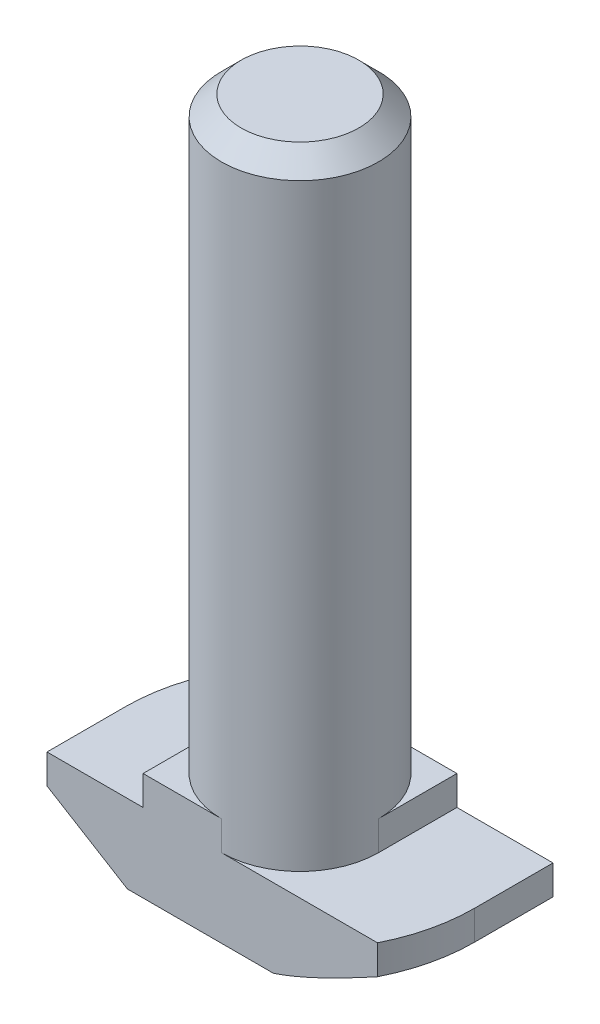
ISO-10303-21;
HEADER;
FILE_DESCRIPTION(('STEP AP214'),'2;1');
FILE_NAME('part.step','',(''),(''),'','','');
FILE_SCHEMA(('AUTOMOTIVE_DESIGN { 1 0 10303 214 1 1 1 1 }'));
ENDSEC;
DATA;
#1=APPLICATION_CONTEXT('core data for automotive mechanical design processes');
#2=APPLICATION_PROTOCOL_DEFINITION('international standard','automotive_design',2000,#1);
#3=PRODUCT_CONTEXT('',#1,'mechanical');
#4=PRODUCT('Part','Part','',(#3));
#5=PRODUCT_RELATED_PRODUCT_CATEGORY('part','',(#4));
#6=PRODUCT_DEFINITION_FORMATION('','',#4);
#7=PRODUCT_DEFINITION_CONTEXT('part definition',#1,'design');
#8=PRODUCT_DEFINITION('design','',#6,#7);
#9=PRODUCT_DEFINITION_SHAPE('','',#8);
#10=(LENGTH_UNIT() NAMED_UNIT(*) SI_UNIT(.MILLI.,.METRE.));
#11=(NAMED_UNIT(*) PLANE_ANGLE_UNIT() SI_UNIT($,.RADIAN.));
#12=(NAMED_UNIT(*) SI_UNIT($,.STERADIAN.) SOLID_ANGLE_UNIT());
#13=UNCERTAINTY_MEASURE_WITH_UNIT(LENGTH_MEASURE(1.E-05),#10,'distance_accuracy_value','');
#14=(GEOMETRIC_REPRESENTATION_CONTEXT(3) GLOBAL_UNCERTAINTY_ASSIGNED_CONTEXT((#13)) GLOBAL_UNIT_ASSIGNED_CONTEXT((#10,
#11,#12)) REPRESENTATION_CONTEXT('',''));
#15=CARTESIAN_POINT('',(0.,0.,0.));
#16=DIRECTION('',(0.,0.,1.));
#17=DIRECTION('',(1.,0.,0.));
#18=AXIS2_PLACEMENT_3D('',#15,#16,#17);
#19=CARTESIAN_POINT('',(-8.9,0.,4.));
#20=DIRECTION('',(1.,0.,0.));
#21=DIRECTION('',(0.,0.,-1.));
#22=AXIS2_PLACEMENT_3D('',#19,#20,#21);
#23=PLANE('',#22);
#24=DIRECTION('',(0.,0.,-1.));
#25=VECTOR('',#24,1.);
#26=CARTESIAN_POINT('',(-8.9,2.5,4.));
#27=LINE('',#26,#25);
#28=CARTESIAN_POINT('',(-8.9,2.5,4.));
#29=VERTEX_POINT('',#28);
#30=CARTESIAN_POINT('',(-8.9,2.5,0.));
#31=VERTEX_POINT('',#30);
#32=EDGE_CURVE('E369',#29,#31,#27,.T.);
#33=ORIENTED_EDGE('',*,*,#32,.F.);
#34=DIRECTION('',(0.,-1.,0.));
#35=VECTOR('',#34,1.);
#36=CARTESIAN_POINT('',(-8.9,0.,4.));
#37=LINE('',#36,#35);
#38=CARTESIAN_POINT('',(-8.9,4.,4.));
#39=VERTEX_POINT('',#38);
#40=EDGE_CURVE('E209',#39,#29,#37,.T.);
#41=ORIENTED_EDGE('',*,*,#40,.F.);
#42=DIRECTION('',(0.,0.,-1.));
#43=VECTOR('',#42,1.);
#44=CARTESIAN_POINT('',(-8.9,4.,4.));
#45=LINE('',#44,#43);
#46=CARTESIAN_POINT('',(-8.9,4.,0.));
#47=VERTEX_POINT('',#46);
#48=EDGE_CURVE('E224',#39,#47,#45,.T.);
#49=ORIENTED_EDGE('',*,*,#48,.T.);
#50=DIRECTION('',(0.,1.,0.));
#51=VECTOR('',#50,1.);
#52=CARTESIAN_POINT('',(-8.9,0.,0.));
#53=LINE('',#52,#51);
#54=EDGE_CURVE('E197',#31,#47,#53,.T.);
#55=ORIENTED_EDGE('',*,*,#54,.F.);
#56=EDGE_LOOP('',(#33,#41,#49,#55));
#57=FACE_BOUND('',#56,.T.);
#58=ADVANCED_FACE('F39',(#57),#23,.F.);
#59=CARTESIAN_POINT('',(8.9,0.,4.));
#60=DIRECTION('',(0.,1.,0.));
#61=DIRECTION('',(0.,0.,1.));
#62=AXIS2_PLACEMENT_3D('',#59,#60,#61);
#63=PLANE('',#62);
#64=DIRECTION('',(1.,0.,0.));
#65=VECTOR('',#64,1.);
#66=CARTESIAN_POINT('',(8.9,0.,4.));
#67=LINE('',#66,#65);
#68=CARTESIAN_POINT('',(-4.8,0.,4.));
#69=VERTEX_POINT('',#68);
#70=CARTESIAN_POINT('',(2.65329983228432,0.,4.));
#71=VERTEX_POINT('',#70);
#72=EDGE_CURVE('E212',#69,#71,#67,.T.);
#73=ORIENTED_EDGE('',*,*,#72,.F.);
#74=DIRECTION('',(0.,0.,-1.));
#75=VECTOR('',#74,1.);
#76=CARTESIAN_POINT('',(-4.8,0.,4.));
#77=LINE('',#76,#75);
#78=CARTESIAN_POINT('',(-4.8,0.,0.));
#79=VERTEX_POINT('',#78);
#80=EDGE_CURVE('E367',#69,#79,#77,.T.);
#81=ORIENTED_EDGE('',*,*,#80,.T.);
#82=CARTESIAN_POINT('',(0.,0.,0.));
#83=DIRECTION('',(0.,-1.,0.));
#84=DIRECTION('',(-1.,0.,0.));
#85=AXIS2_PLACEMENT_3D('',#82,#83,#84);
#86=CIRCLE('',#85,4.8);
#87=CARTESIAN_POINT('',(-2.65329983228432,0.,-4.));
#88=VERTEX_POINT('',#87);
#89=EDGE_CURVE('E366',#79,#88,#86,.T.);
#90=ORIENTED_EDGE('',*,*,#89,.T.);
#91=DIRECTION('',(1.,0.,0.));
#92=VECTOR('',#91,1.);
#93=CARTESIAN_POINT('',(8.9,0.,-4.));
#94=LINE('',#93,#92);
#95=CARTESIAN_POINT('',(4.8,0.,-4.));
#96=VERTEX_POINT('',#95);
#97=EDGE_CURVE('E208',#88,#96,#94,.T.);
#98=ORIENTED_EDGE('',*,*,#97,.T.);
#99=DIRECTION('',(0.,0.,1.));
#100=VECTOR('',#99,1.);
#101=CARTESIAN_POINT('',(4.8,0.,-8.9));
#102=LINE('',#101,#100);
#103=CARTESIAN_POINT('',(4.8,0.,0.));
#104=VERTEX_POINT('',#103);
#105=EDGE_CURVE('E55',#96,#104,#102,.T.);
#106=ORIENTED_EDGE('',*,*,#105,.T.);
#107=CARTESIAN_POINT('',(0.,0.,0.));
#108=DIRECTION('',(0.,-1.,0.));
#109=DIRECTION('',(1.,0.,0.));
#110=AXIS2_PLACEMENT_3D('',#107,#108,#109);
#111=CIRCLE('',#110,4.8);
#112=EDGE_CURVE('E155',#104,#71,#111,.T.);
#113=ORIENTED_EDGE('',*,*,#112,.T.);
#114=EDGE_LOOP('',(#73,#81,#90,#98,#106,#113));
#115=FACE_BOUND('',#114,.T.);
#116=ADVANCED_FACE('F270',(#115),#63,.F.);
#117=CARTESIAN_POINT('',(8.9,0.,4.));
#118=DIRECTION('',(-1.,0.,0.));
#119=DIRECTION('',(0.,0.,1.));
#120=AXIS2_PLACEMENT_3D('',#117,#118,#119);
#121=PLANE('',#120);
#122=DIRECTION('',(0.,0.,1.));
#123=VECTOR('',#122,1.);
#124=CARTESIAN_POINT('',(8.9,2.5,-8.9));
#125=LINE('',#124,#123);
#126=CARTESIAN_POINT('',(8.9,2.5,-4.));
#127=VERTEX_POINT('',#126);
#128=CARTESIAN_POINT('',(8.9,2.5,0.));
#129=VERTEX_POINT('',#128);
#130=EDGE_CURVE('E147',#127,#129,#125,.T.);
#131=ORIENTED_EDGE('',*,*,#130,.F.);
#132=DIRECTION('',(0.,1.,0.));
#133=VECTOR('',#132,1.);
#134=CARTESIAN_POINT('',(8.9,0.,-4.));
#135=LINE('',#134,#133);
#136=CARTESIAN_POINT('',(8.9,4.,-4.));
#137=VERTEX_POINT('',#136);
#138=EDGE_CURVE('E227',#127,#137,#135,.T.);
#139=ORIENTED_EDGE('',*,*,#138,.T.);
#140=DIRECTION('',(0.,0.,-1.));
#141=VECTOR('',#140,1.);
#142=CARTESIAN_POINT('',(8.9,4.,4.));
#143=LINE('',#142,#141);
#144=CARTESIAN_POINT('',(8.9,4.,0.));
#145=VERTEX_POINT('',#144);
#146=EDGE_CURVE('E175',#145,#137,#143,.T.);
#147=ORIENTED_EDGE('',*,*,#146,.F.);
#148=DIRECTION('',(0.,1.,0.));
#149=VECTOR('',#148,1.);
#150=CARTESIAN_POINT('',(8.9,0.,0.));
#151=LINE('',#150,#149);
#152=EDGE_CURVE('E168',#129,#145,#151,.T.);
#153=ORIENTED_EDGE('',*,*,#152,.F.);
#154=EDGE_LOOP('',(#131,#139,#147,#153));
#155=FACE_BOUND('',#154,.T.);
#156=ADVANCED_FACE('F173',(#155),#121,.F.);
#157=CARTESIAN_POINT('',(0.,0.,4.));
#158=DIRECTION('',(0.,0.,-1.));
#159=DIRECTION('',(-1.,0.,0.));
#160=AXIS2_PLACEMENT_3D('',#157,#158,#159);
#161=PLANE('',#160);
#162=DIRECTION('',(-0.853796175794036,0.520607424264656,0.));
#163=VECTOR('',#162,1.);
#164=CARTESIAN_POINT('',(-8.9,2.5,4.));
#165=LINE('',#164,#163);
#166=EDGE_CURVE('E375',#69,#29,#165,.T.);
#167=ORIENTED_EDGE('',*,*,#166,.F.);
#168=ORIENTED_EDGE('',*,*,#72,.T.);
#169=CARTESIAN_POINT('',(7.95117168412038,2.5003812948523,4.));
#170=CARTESIAN_POINT('',(7.73552594180779,2.38294262104349,4.));
#171=CARTESIAN_POINT('',(7.51949196287052,2.26620761305275,4.));
#172=CARTESIAN_POINT('',(7.08640702943254,2.03458295404349,4.));
#173=CARTESIAN_POINT('',(6.86935596494317,1.91969350884632,4.));
#174=CARTESIAN_POINT('',(6.43326841812792,1.6918189237928,4.));
#175=CARTESIAN_POINT('',(6.21422761700308,1.57884202880893,4.));
#176=CARTESIAN_POINT('',(5.77463734455681,1.3558784061402,4.));
#177=CARTESIAN_POINT('',(5.55408794028136,1.24589154663778,4.));
#178=CARTESIAN_POINT('',(5.11647910281973,1.03243373636638,4.));
#179=CARTESIAN_POINT('',(4.89946541196746,0.92886934419743,4.));
#180=CARTESIAN_POINT('',(4.46314517755054,0.726599943828819,4.));
#181=CARTESIAN_POINT('',(4.24383839666258,0.627895444761259,4.));
#182=CARTESIAN_POINT('',(3.80261128872497,0.437105119516572,4.));
#183=CARTESIAN_POINT('',(3.5806938708347,0.345012613183118,4.));
#184=CARTESIAN_POINT('',(3.13341004119999,0.169681531704238,4.));
#185=CARTESIAN_POINT('',(2.90804453781551,0.0864406691133928,4.));
#186=CARTESIAN_POINT('',(2.46564049107812,-0.0637337384147157,4.));
#187=CARTESIAN_POINT('',(2.24882314531661,-0.131311270143758,4.));
#188=CARTESIAN_POINT('',(1.81134539093152,-0.252017085141675,4.));
#189=CARTESIAN_POINT('',(1.59068966949939,-0.305161832872051,4.));
#190=CARTESIAN_POINT('',(1.25578974895032,-0.37125386899099,4.));
#191=CARTESIAN_POINT('',(1.1428915032614,-0.391082257285261,4.));
#192=CARTESIAN_POINT('',(0.916303642162891,-0.425522742673794,4.));
#193=CARTESIAN_POINT('',(0.802614110911478,-0.440135386106777,4.));
#194=CARTESIAN_POINT('',(0.574171741878051,-0.463762938801405,4.));
#195=CARTESIAN_POINT('',(0.459416448807066,-0.472754337723224,4.));
#196=CARTESIAN_POINT('',(0.229544837125645,-0.484799371089924,4.));
#197=CARTESIAN_POINT('',(0.11442837922421,-0.487850330163754,4.));
#198=CARTESIAN_POINT('',(-0.000700000000000364,-0.487804840701222,4.));
#199=B_SPLINE_CURVE_WITH_KNOTS('',3,(#169,#170,#171,#172,#173,#174,#175,#176,#177,#178,#179,
#180,#181,#182,#183,#184,#185,#186,#187,#188,#189,#190,#191,#192,#193,#194,#195,#196,#197,#198),
.UNSPECIFIED.,.F.,.F.,(4,2,2,2,2,2,2,2,2,2,2,2,2,2,4),(0.,0.73665607857229,1.47339374819651,
2.212756769811,2.95208714311461,3.6734194697194,4.39482720444832,5.11549552795205,
5.83597716113291,6.51694414905028,7.19713101684283,7.54090798827143,7.88464893918285,
8.22981810256985,8.57514268242548),.UNSPECIFIED.);
#200=CARTESIAN_POINT('',(7.95047168412038,2.5,4.));
#201=VERTEX_POINT('',#200);
#202=EDGE_CURVE('E319',#201,#71,#199,.T.);
#203=ORIENTED_EDGE('',*,*,#202,.F.);
#204=DIRECTION('',(0.,1.,0.));
#205=VECTOR('',#204,1.);
#206=CARTESIAN_POINT('',(7.95047168412038,0.,4.));
#207=LINE('',#206,#205);
#208=CARTESIAN_POINT('',(7.95047168412038,4.,4.));
#209=VERTEX_POINT('',#208);
#210=EDGE_CURVE('E170',#201,#209,#207,.T.);
#211=ORIENTED_EDGE('',*,*,#210,.T.);
#212=DIRECTION('',(-1.,0.,0.));
#213=VECTOR('',#212,1.);
#214=CARTESIAN_POINT('',(8.9,4.,4.));
#215=LINE('',#214,#213);
#216=CARTESIAN_POINT('',(0.,4.,4.));
#217=VERTEX_POINT('',#216);
#218=EDGE_CURVE('E216',#209,#217,#215,.T.);
#219=ORIENTED_EDGE('',*,*,#218,.T.);
#220=DIRECTION('',(0.,1.,0.));
#221=VECTOR('',#220,1.);
#222=CARTESIAN_POINT('',(0.,-1.65685424949238,4.));
#223=LINE('',#222,#221);
#224=CARTESIAN_POINT('',(0.,5.5,4.));
#225=VERTEX_POINT('',#224);
#226=EDGE_CURVE('E193',#217,#225,#223,.T.);
#227=ORIENTED_EDGE('',*,*,#226,.T.);
#228=DIRECTION('',(-1.,0.,0.));
#229=VECTOR('',#228,1.);
#230=CARTESIAN_POINT('',(-4.,5.5,4.));
#231=LINE('',#230,#229);
#232=CARTESIAN_POINT('',(-4.,5.5,4.));
#233=VERTEX_POINT('',#232);
#234=EDGE_CURVE('E218',#225,#233,#231,.T.);
#235=ORIENTED_EDGE('',*,*,#234,.T.);
#236=DIRECTION('',(0.,-1.,0.));
#237=VECTOR('',#236,1.);
#238=CARTESIAN_POINT('',(-4.,4.,4.));
#239=LINE('',#238,#237);
#240=CARTESIAN_POINT('',(-4.,4.,4.));
#241=VERTEX_POINT('',#240);
#242=EDGE_CURVE('E220',#233,#241,#239,.T.);
#243=ORIENTED_EDGE('',*,*,#242,.T.);
#244=DIRECTION('',(-1.,0.,0.));
#245=VECTOR('',#244,1.);
#246=CARTESIAN_POINT('',(-8.9,4.,4.));
#247=LINE('',#246,#245);
#248=EDGE_CURVE('E222',#241,#39,#247,.T.);
#249=ORIENTED_EDGE('',*,*,#248,.T.);
#250=ORIENTED_EDGE('',*,*,#40,.T.);
#251=EDGE_LOOP('',(#167,#168,#203,#211,#219,#227,#235,#243,#249,#250));
#252=FACE_BOUND('',#251,.T.);
#253=ADVANCED_FACE('F281',(#252),#161,.F.);
#254=CARTESIAN_POINT('',(0.,0.,-4.));
#255=DIRECTION('',(0.,0.,-1.));
#256=DIRECTION('',(-1.,0.,0.));
#257=AXIS2_PLACEMENT_3D('',#254,#255,#256);
#258=PLANE('',#257);
#259=ORIENTED_EDGE('',*,*,#97,.F.);
#260=CARTESIAN_POINT('',(0.000700000000000375,-0.487804840701222,-4.));
#261=CARTESIAN_POINT('',(-0.0911783891396318,-0.48782848460975,-4.));
#262=CARTESIAN_POINT('',(-0.183052746172593,-0.485894534221646,-4.));
#263=CARTESIAN_POINT('',(-0.366624394777082,-0.478214110158694,-4.));
#264=CARTESIAN_POINT('',(-0.458321717815279,-0.472468391698149,-4.));
#265=CARTESIAN_POINT('',(-0.641197389589646,-0.457284413495929,-4.));
#266=CARTESIAN_POINT('',(-0.732376445680467,-0.447854631312074,-4.));
#267=CARTESIAN_POINT('',(-0.914302231773763,-0.425490539884402,-4.));
#268=CARTESIAN_POINT('',(-1.00504894282095,-0.41255607839799,-4.));
#269=CARTESIAN_POINT('',(-1.27475669839242,-0.369111241216707,-4.));
#270=CARTESIAN_POINT('',(-1.45295798960378,-0.333803642672856,-4.));
#271=CARTESIAN_POINT('',(-1.80688694554488,-0.252374259841994,-4.));
#272=CARTESIAN_POINT('',(-1.98261350049563,-0.206247777936689,-4.));
#273=CARTESIAN_POINT('',(-2.40843477616905,-0.0830176290147687,-4.));
#274=CARTESIAN_POINT('',(-2.65716286909735,-0.00122224492027907,-4.));
#275=CARTESIAN_POINT('',(-3.1500236667871,0.175317023068226,-4.));
#276=CARTESIAN_POINT('',(-3.39415374276215,0.270068072754652,-4.));
#277=CARTESIAN_POINT('',(-3.87928874246701,0.469058436828284,-4.));
#278=CARTESIAN_POINT('',(-4.12028285320838,0.573323871149427,-4.));
#279=CARTESIAN_POINT('',(-4.59919632282166,0.788504405818799,-4.));
#280=CARTESIAN_POINT('',(-4.83711633279242,0.899418069039211,-4.));
#281=CARTESIAN_POINT('',(-5.31822851183188,1.1297988974704,-4.));
#282=CARTESIAN_POINT('',(-5.56134348218909,1.24942652452964,-4.));
#283=CARTESIAN_POINT('',(-6.045636996258,1.49257282867588,-4.));
#284=CARTESIAN_POINT('',(-6.28681538137222,1.61609182045058,-4.));
#285=CARTESIAN_POINT('',(-6.76588702271679,1.86515627626158,-4.));
#286=CARTESIAN_POINT('',(-7.0037914098582,1.99068039524177,-4.));
#287=CARTESIAN_POINT('',(-7.47834127800901,2.24398618358021,-4.));
#288=CARTESIAN_POINT('',(-7.71498697875761,2.37176744085524,-4.));
#289=CARTESIAN_POINT('',(-7.95117168412038,2.50038129485229,-4.));
#290=B_SPLINE_CURVE_WITH_KNOTS('',3,(#260,#261,#262,#263,#264,#265,#266,#267,#268,#269,#270,
#271,#272,#273,#274,#275,#276,#277,#278,#279,#280,#281,#282,#283,#284,#285,#286,#287,#288,#289),
.UNSPECIFIED.,.F.,.F.,(4,2,2,2,2,2,2,2,2,2,2,2,2,2,4),(0.,0.275607667670162,0.551160746311937,
0.82608343769266,1.10101807357745,1.64556230190507,2.19034341346489,2.97528858833922,
3.76066968678114,4.54827578228531,5.33571223306797,6.14852584679743,6.96140536089395,
7.76835733370051,8.57516347444109),.UNSPECIFIED.);
#291=CARTESIAN_POINT('',(-7.95047168412038,2.5,-4.));
#292=VERTEX_POINT('',#291);
#293=EDGE_CURVE('E313',#88,#292,#290,.T.);
#294=ORIENTED_EDGE('',*,*,#293,.T.);
#295=DIRECTION('',(0.,1.,0.));
#296=VECTOR('',#295,1.);
#297=CARTESIAN_POINT('',(-7.95047168412038,0.,-4.));
#298=LINE('',#297,#296);
#299=CARTESIAN_POINT('',(-7.95047168412038,4.,-4.));
#300=VERTEX_POINT('',#299);
#301=EDGE_CURVE('E179',#292,#300,#298,.T.);
#302=ORIENTED_EDGE('',*,*,#301,.T.);
#303=DIRECTION('',(-1.,0.,0.));
#304=VECTOR('',#303,1.);
#305=CARTESIAN_POINT('',(-8.9,4.,-4.));
#306=LINE('',#305,#304);
#307=CARTESIAN_POINT('',(0.,4.,-4.));
#308=VERTEX_POINT('',#307);
#309=EDGE_CURVE('E213',#308,#300,#306,.T.);
#310=ORIENTED_EDGE('',*,*,#309,.F.);
#311=DIRECTION('',(0.,1.,0.));
#312=VECTOR('',#311,1.);
#313=CARTESIAN_POINT('',(0.,-1.65685424949238,-4.));
#314=LINE('',#313,#312);
#315=CARTESIAN_POINT('',(0.,5.5,-4.));
#316=VERTEX_POINT('',#315);
#317=EDGE_CURVE('E204',#308,#316,#314,.T.);
#318=ORIENTED_EDGE('',*,*,#317,.T.);
#319=DIRECTION('',(-1.,0.,0.));
#320=VECTOR('',#319,1.);
#321=CARTESIAN_POINT('',(-4.,5.5,-4.));
#322=LINE('',#321,#320);
#323=CARTESIAN_POINT('',(4.,5.5,-4.));
#324=VERTEX_POINT('',#323);
#325=EDGE_CURVE('E235',#324,#316,#322,.T.);
#326=ORIENTED_EDGE('',*,*,#325,.F.);
#327=DIRECTION('',(0.,1.,0.));
#328=VECTOR('',#327,1.);
#329=CARTESIAN_POINT('',(4.,4.,-4.));
#330=LINE('',#329,#328);
#331=CARTESIAN_POINT('',(4.,4.,-4.));
#332=VERTEX_POINT('',#331);
#333=EDGE_CURVE('E232',#332,#324,#330,.T.);
#334=ORIENTED_EDGE('',*,*,#333,.F.);
#335=DIRECTION('',(-1.,0.,0.));
#336=VECTOR('',#335,1.);
#337=CARTESIAN_POINT('',(8.9,4.,-4.));
#338=LINE('',#337,#336);
#339=EDGE_CURVE('E229',#137,#332,#338,.T.);
#340=ORIENTED_EDGE('',*,*,#339,.F.);
#341=ORIENTED_EDGE('',*,*,#138,.F.);
#342=DIRECTION('',(-0.853796175794036,-0.520607424264656,0.));
#343=VECTOR('',#342,1.);
#344=CARTESIAN_POINT('',(1.3009540329575,-2.13356461405031,-4.));
#345=LINE('',#344,#343);
#346=EDGE_CURVE('E151',#127,#96,#345,.T.);
#347=ORIENTED_EDGE('',*,*,#346,.T.);
#348=EDGE_LOOP('',(#259,#294,#302,#310,#318,#326,#334,#340,#341,#347));
#349=FACE_BOUND('',#348,.T.);
#350=ADVANCED_FACE('F304',(#349),#258,.T.);
#351=CARTESIAN_POINT('',(0.,0.,0.));
#352=DIRECTION('',(0.,1.,0.));
#353=DIRECTION('',(0.,0.,1.));
#354=AXIS2_PLACEMENT_3D('',#351,#352,#353);
#355=CYLINDRICAL_SURFACE('',#354,8.9);
#356=CARTESIAN_POINT('',(0.,2.5,0.));
#357=DIRECTION('',(0.,-1.,0.));
#358=DIRECTION('',(-1.,0.,0.));
#359=AXIS2_PLACEMENT_3D('',#356,#357,#358);
#360=CIRCLE('',#359,8.9);
#361=EDGE_CURVE('E63',#31,#292,#360,.T.);
#362=ORIENTED_EDGE('',*,*,#361,.F.);
#363=ORIENTED_EDGE('',*,*,#54,.T.);
#364=CARTESIAN_POINT('',(0.,4.,0.));
#365=DIRECTION('',(0.,-1.,0.));
#366=DIRECTION('',(0.,0.,-1.));
#367=AXIS2_PLACEMENT_3D('',#364,#365,#366);
#368=CIRCLE('',#367,8.9);
#369=EDGE_CURVE('E176',#47,#300,#368,.T.);
#370=ORIENTED_EDGE('',*,*,#369,.T.);
#371=ORIENTED_EDGE('',*,*,#301,.F.);
#372=EDGE_LOOP('',(#362,#363,#370,#371));
#373=FACE_BOUND('',#372,.T.);
#374=ADVANCED_FACE('F308',(#373),#355,.T.);
#375=CARTESIAN_POINT('',(0.,0.,0.));
#376=DIRECTION('',(0.,1.,0.));
#377=DIRECTION('',(0.,0.,1.));
#378=AXIS2_PLACEMENT_3D('',#375,#376,#377);
#379=CYLINDRICAL_SURFACE('',#378,8.9);
#380=CARTESIAN_POINT('',(0.,2.5,0.));
#381=DIRECTION('',(0.,-1.,0.));
#382=DIRECTION('',(1.,0.,0.));
#383=AXIS2_PLACEMENT_3D('',#380,#381,#382);
#384=CIRCLE('',#383,8.9);
#385=EDGE_CURVE('E160',#129,#201,#384,.T.);
#386=ORIENTED_EDGE('',*,*,#385,.F.);
#387=ORIENTED_EDGE('',*,*,#152,.T.);
#388=CARTESIAN_POINT('',(0.,4.,0.));
#389=DIRECTION('',(0.,-1.,0.));
#390=DIRECTION('',(0.,0.,-1.));
#391=AXIS2_PLACEMENT_3D('',#388,#389,#390);
#392=CIRCLE('',#391,8.9);
#393=EDGE_CURVE('E181',#145,#209,#392,.T.);
#394=ORIENTED_EDGE('',*,*,#393,.T.);
#395=ORIENTED_EDGE('',*,*,#210,.F.);
#396=EDGE_LOOP('',(#386,#387,#394,#395));
#397=FACE_BOUND('',#396,.T.);
#398=ADVANCED_FACE('F166',(#397),#379,.T.);
#399=CARTESIAN_POINT('',(-4.,5.5,4.));
#400=DIRECTION('',(0.,-1.,0.));
#401=DIRECTION('',(0.,0.,-1.));
#402=AXIS2_PLACEMENT_3D('',#399,#400,#401);
#403=PLANE('',#402);
#404=CARTESIAN_POINT('',(0.,5.5,0.));
#405=DIRECTION('',(0.,1.,0.));
#406=DIRECTION('',(0.,0.,1.));
#407=AXIS2_PLACEMENT_3D('',#404,#405,#406);
#408=CIRCLE('',#407,4.);
#409=CARTESIAN_POINT('',(4.,5.5,0.));
#410=VERTEX_POINT('',#409);
#411=EDGE_CURVE('E186',#410,#316,#408,.T.);
#412=ORIENTED_EDGE('',*,*,#411,.F.);
#413=DIRECTION('',(0.,0.,-1.));
#414=VECTOR('',#413,1.);
#415=CARTESIAN_POINT('',(4.,5.5,4.));
#416=LINE('',#415,#414);
#417=EDGE_CURVE('E248',#410,#324,#416,.T.);
#418=ORIENTED_EDGE('',*,*,#417,.T.);
#419=ORIENTED_EDGE('',*,*,#325,.T.);
#420=EDGE_LOOP('',(#412,#418,#419));
#421=FACE_BOUND('',#420,.T.);
#422=ADVANCED_FACE('F294',(#421),#403,.F.);
#423=CARTESIAN_POINT('',(-4.,5.5,0.));
#424=VERTEX_POINT('',#423);
#425=EDGE_CURVE('E189',#424,#225,#408,.T.);
#426=ORIENTED_EDGE('',*,*,#425,.F.);
#427=DIRECTION('',(0.,0.,-1.));
#428=VECTOR('',#427,1.);
#429=CARTESIAN_POINT('',(-4.,5.5,4.));
#430=LINE('',#429,#428);
#431=EDGE_CURVE('E245',#233,#424,#430,.T.);
#432=ORIENTED_EDGE('',*,*,#431,.F.);
#433=ORIENTED_EDGE('',*,*,#234,.F.);
#434=EDGE_LOOP('',(#426,#432,#433));
#435=FACE_BOUND('',#434,.T.);
#436=ADVANCED_FACE('F286',(#435),#403,.F.);
#437=CARTESIAN_POINT('',(8.9,4.,4.));
#438=DIRECTION('',(0.,-1.,0.));
#439=DIRECTION('',(0.,0.,-1.));
#440=AXIS2_PLACEMENT_3D('',#437,#438,#439);
#441=PLANE('',#440);
#442=ORIENTED_EDGE('',*,*,#218,.F.);
#443=ORIENTED_EDGE('',*,*,#393,.F.);
#444=ORIENTED_EDGE('',*,*,#146,.T.);
#445=ORIENTED_EDGE('',*,*,#339,.T.);
#446=DIRECTION('',(0.,0.,-1.));
#447=VECTOR('',#446,1.);
#448=CARTESIAN_POINT('',(4.,4.,4.));
#449=LINE('',#448,#447);
#450=CARTESIAN_POINT('',(4.,4.,0.));
#451=VERTEX_POINT('',#450);
#452=EDGE_CURVE('E250',#451,#332,#449,.T.);
#453=ORIENTED_EDGE('',*,*,#452,.F.);
#454=CARTESIAN_POINT('',(0.,4.,0.));
#455=DIRECTION('',(0.,-1.,0.));
#456=DIRECTION('',(0.,0.,-1.));
#457=AXIS2_PLACEMENT_3D('',#454,#455,#456);
#458=CIRCLE('',#457,4.);
#459=EDGE_CURVE('E190',#451,#217,#458,.T.);
#460=ORIENTED_EDGE('',*,*,#459,.T.);
#461=EDGE_LOOP('',(#442,#443,#444,#445,#453,#460));
#462=FACE_BOUND('',#461,.T.);
#463=ADVANCED_FACE('F282',(#462),#441,.F.);
#464=CARTESIAN_POINT('',(4.,4.,4.));
#465=DIRECTION('',(-1.,0.,0.));
#466=DIRECTION('',(0.,0.,1.));
#467=AXIS2_PLACEMENT_3D('',#464,#465,#466);
#468=PLANE('',#467);
#469=ORIENTED_EDGE('',*,*,#417,.F.);
#470=DIRECTION('',(0.,1.,0.));
#471=VECTOR('',#470,1.);
#472=CARTESIAN_POINT('',(4.,-1.65685424949238,0.));
#473=LINE('',#472,#471);
#474=EDGE_CURVE('E194',#451,#410,#473,.T.);
#475=ORIENTED_EDGE('',*,*,#474,.F.);
#476=ORIENTED_EDGE('',*,*,#452,.T.);
#477=ORIENTED_EDGE('',*,*,#333,.T.);
#478=EDGE_LOOP('',(#469,#475,#476,#477));
#479=FACE_BOUND('',#478,.T.);
#480=ADVANCED_FACE('F285',(#479),#468,.F.);
#481=CARTESIAN_POINT('',(-4.,4.,4.));
#482=DIRECTION('',(1.,0.,0.));
#483=DIRECTION('',(0.,0.,-1.));
#484=AXIS2_PLACEMENT_3D('',#481,#482,#483);
#485=PLANE('',#484);
#486=ORIENTED_EDGE('',*,*,#431,.T.);
#487=DIRECTION('',(0.,1.,0.));
#488=VECTOR('',#487,1.);
#489=CARTESIAN_POINT('',(-4.,-1.65685424949238,0.));
#490=LINE('',#489,#488);
#491=CARTESIAN_POINT('',(-4.,4.,0.));
#492=VERTEX_POINT('',#491);
#493=EDGE_CURVE('E200',#492,#424,#490,.T.);
#494=ORIENTED_EDGE('',*,*,#493,.F.);
#495=DIRECTION('',(0.,0.,-1.));
#496=VECTOR('',#495,1.);
#497=CARTESIAN_POINT('',(-4.,4.,4.));
#498=LINE('',#497,#496);
#499=EDGE_CURVE('E242',#241,#492,#498,.T.);
#500=ORIENTED_EDGE('',*,*,#499,.F.);
#501=ORIENTED_EDGE('',*,*,#242,.F.);
#502=EDGE_LOOP('',(#486,#494,#500,#501));
#503=FACE_BOUND('',#502,.T.);
#504=ADVANCED_FACE('F290',(#503),#485,.F.);
#505=CARTESIAN_POINT('',(-8.9,4.,4.));
#506=DIRECTION('',(0.,-1.,0.));
#507=DIRECTION('',(0.,0.,-1.));
#508=AXIS2_PLACEMENT_3D('',#505,#506,#507);
#509=PLANE('',#508);
#510=ORIENTED_EDGE('',*,*,#309,.T.);
#511=ORIENTED_EDGE('',*,*,#369,.F.);
#512=ORIENTED_EDGE('',*,*,#48,.F.);
#513=ORIENTED_EDGE('',*,*,#248,.F.);
#514=ORIENTED_EDGE('',*,*,#499,.T.);
#515=CARTESIAN_POINT('',(0.,4.,0.));
#516=DIRECTION('',(0.,-1.,0.));
#517=DIRECTION('',(0.,0.,-1.));
#518=AXIS2_PLACEMENT_3D('',#515,#516,#517);
#519=CIRCLE('',#518,4.);
#520=EDGE_CURVE('E201',#492,#308,#519,.T.);
#521=ORIENTED_EDGE('',*,*,#520,.T.);
#522=EDGE_LOOP('',(#510,#511,#512,#513,#514,#521));
#523=FACE_BOUND('',#522,.T.);
#524=ADVANCED_FACE('F298',(#523),#509,.F.);
#525=CARTESIAN_POINT('',(0.,-1.65685424949238,0.));
#526=DIRECTION('',(0.,1.,0.));
#527=DIRECTION('',(0.,0.,1.));
#528=AXIS2_PLACEMENT_3D('',#525,#526,#527);
#529=CYLINDRICAL_SURFACE('',#528,4.);
#530=CARTESIAN_POINT('',(0.,34.5,0.));
#531=DIRECTION('',(0.,1.,0.));
#532=DIRECTION('',(0.,0.,1.));
#533=AXIS2_PLACEMENT_3D('',#530,#531,#532);
#534=CIRCLE('',#533,4.);
#535=CARTESIAN_POINT('',(0.,34.5,4.));
#536=VERTEX_POINT('',#535);
#537=EDGE_CURVE('E11',#536,#536,#534,.F.);
#538=ORIENTED_EDGE('',*,*,#537,.T.);
#539=EDGE_LOOP('',(#538));
#540=FACE_BOUND('',#539,.T.);
#541=ORIENTED_EDGE('',*,*,#474,.T.);
#542=ORIENTED_EDGE('',*,*,#411,.T.);
#543=ORIENTED_EDGE('',*,*,#317,.F.);
#544=ORIENTED_EDGE('',*,*,#520,.F.);
#545=ORIENTED_EDGE('',*,*,#493,.T.);
#546=ORIENTED_EDGE('',*,*,#425,.T.);
#547=ORIENTED_EDGE('',*,*,#226,.F.);
#548=ORIENTED_EDGE('',*,*,#459,.F.);
#549=EDGE_LOOP('',(#541,#542,#543,#544,#545,#546,#547,#548));
#550=FACE_BOUND('',#549,.T.);
#551=ADVANCED_FACE('F302',(#540,#550),#529,.T.);
#552=CARTESIAN_POINT('',(0.,35.5,0.));
#553=DIRECTION('',(0.,1.,0.));
#554=DIRECTION('',(0.,0.,1.));
#555=AXIS2_PLACEMENT_3D('',#552,#553,#554);
#556=PLANE('',#555);
#557=CARTESIAN_POINT('',(0.,35.5,0.));
#558=DIRECTION('',(0.,1.,0.));
#559=DIRECTION('',(0.,0.,1.));
#560=AXIS2_PLACEMENT_3D('',#557,#558,#559);
#561=CIRCLE('',#560,3.);
#562=CARTESIAN_POINT('',(0.,35.5,3.));
#563=VERTEX_POINT('',#562);
#564=EDGE_CURVE('E48',#563,#563,#561,.T.);
#565=ORIENTED_EDGE('',*,*,#564,.T.);
#566=EDGE_LOOP('',(#565));
#567=FACE_BOUND('',#566,.T.);
#568=ADVANCED_FACE('F255',(#567),#556,.T.);
#569=CARTESIAN_POINT('',(8.9,2.5,-8.9));
#570=DIRECTION('',(0.520607424264656,-0.853796175794036,0.));
#571=DIRECTION('',(0.853796175794036,0.520607424264656,0.));
#572=AXIS2_PLACEMENT_3D('',#569,#570,#571);
#573=PLANE('',#572);
#574=ORIENTED_EDGE('',*,*,#130,.T.);
#575=DIRECTION('',(0.853796175794036,0.520607424264656,0.));
#576=VECTOR('',#575,1.);
#577=CARTESIAN_POINT('',(8.9,2.5,0.));
#578=LINE('',#577,#576);
#579=EDGE_CURVE('E150',#104,#129,#578,.T.);
#580=ORIENTED_EDGE('',*,*,#579,.F.);
#581=ORIENTED_EDGE('',*,*,#105,.F.);
#582=ORIENTED_EDGE('',*,*,#346,.F.);
#583=EDGE_LOOP('',(#574,#580,#581,#582));
#584=FACE_BOUND('',#583,.T.);
#585=ADVANCED_FACE('F149',(#584),#573,.T.);
#586=CARTESIAN_POINT('',(0.,0.,0.));
#587=DIRECTION('',(0.,1.,0.));
#588=DIRECTION('',(0.,0.,1.));
#589=AXIS2_PLACEMENT_3D('',#586,#587,#588);
#590=CONICAL_SURFACE('',#589,4.8,1.0232340908549);
#591=ORIENTED_EDGE('',*,*,#202,.T.);
#592=ORIENTED_EDGE('',*,*,#112,.F.);
#593=ORIENTED_EDGE('',*,*,#579,.T.);
#594=ORIENTED_EDGE('',*,*,#385,.T.);
#595=EDGE_LOOP('',(#591,#592,#593,#594));
#596=FACE_BOUND('',#595,.T.);
#597=ADVANCED_FACE('F159',(#596),#590,.T.);
#598=CARTESIAN_POINT('',(-8.9,2.5,4.));
#599=DIRECTION('',(-0.520607424264656,-0.853796175794036,0.));
#600=DIRECTION('',(0.853796175794036,-0.520607424264656,0.));
#601=AXIS2_PLACEMENT_3D('',#598,#599,#600);
#602=PLANE('',#601);
#603=ORIENTED_EDGE('',*,*,#32,.T.);
#604=DIRECTION('',(-0.853796175794036,0.520607424264656,0.));
#605=VECTOR('',#604,1.);
#606=CARTESIAN_POINT('',(-8.9,2.5,0.));
#607=LINE('',#606,#605);
#608=EDGE_CURVE('E372',#79,#31,#607,.T.);
#609=ORIENTED_EDGE('',*,*,#608,.F.);
#610=ORIENTED_EDGE('',*,*,#80,.F.);
#611=ORIENTED_EDGE('',*,*,#166,.T.);
#612=EDGE_LOOP('',(#603,#609,#610,#611));
#613=FACE_BOUND('',#612,.T.);
#614=ADVANCED_FACE('F260',(#613),#602,.T.);
#615=CARTESIAN_POINT('',(0.,0.,0.));
#616=DIRECTION('',(0.,1.,0.));
#617=DIRECTION('',(0.,0.,1.));
#618=AXIS2_PLACEMENT_3D('',#615,#616,#617);
#619=CONICAL_SURFACE('',#618,4.8,1.0232340908549);
#620=ORIENTED_EDGE('',*,*,#89,.F.);
#621=ORIENTED_EDGE('',*,*,#608,.T.);
#622=ORIENTED_EDGE('',*,*,#361,.T.);
#623=ORIENTED_EDGE('',*,*,#293,.F.);
#624=EDGE_LOOP('',(#620,#621,#622,#623));
#625=FACE_BOUND('',#624,.T.);
#626=ADVANCED_FACE('F258',(#625),#619,.T.);
#627=CARTESIAN_POINT('',(0.,35.5,0.));
#628=DIRECTION('',(0.,-1.,0.));
#629=DIRECTION('',(0.,0.,-1.));
#630=AXIS2_PLACEMENT_3D('',#627,#628,#629);
#631=CONICAL_SURFACE('',#630,3.,0.785398163397443);
#632=ORIENTED_EDGE('',*,*,#537,.F.);
#633=EDGE_LOOP('',(#632));
#634=FACE_BOUND('',#633,.T.);
#635=ORIENTED_EDGE('',*,*,#564,.F.);
#636=EDGE_LOOP('',(#635));
#637=FACE_BOUND('',#636,.T.);
#638=ADVANCED_FACE('F42',(#634,#637),#631,.T.);
#639=CLOSED_SHELL('',(#58,#116,#156,#253,#350,#374,#398,#422,#436,#463,#480,#504,#524,#551,#568,
#585,#597,#614,#626,#638));
#640=MANIFOLD_SOLID_BREP('B2',#639);
#641=ADVANCED_BREP_SHAPE_REPRESENTATION('',(#18,#640),#14);
#642=SHAPE_DEFINITION_REPRESENTATION(#9,#641);
ENDSEC;
END-ISO-10303-21;
